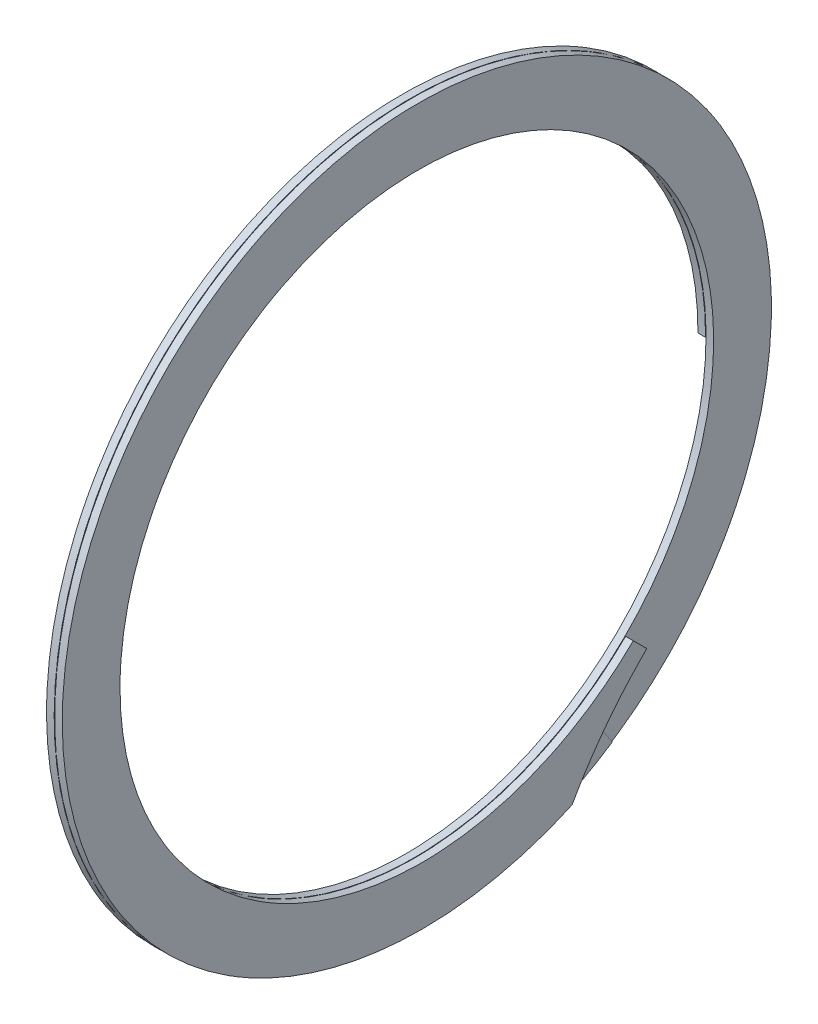
ISO-10303-21;
HEADER;
FILE_DESCRIPTION(('STEP AP214'),'2;1');
FILE_NAME('part.step','',(''),(''),'','','');
FILE_SCHEMA(('AUTOMOTIVE_DESIGN { 1 0 10303 214 1 1 1 1 }'));
ENDSEC;
DATA;
#1=APPLICATION_CONTEXT('core data for automotive mechanical design processes');
#2=APPLICATION_PROTOCOL_DEFINITION('international standard','automotive_design',2000,#1);
#3=PRODUCT_CONTEXT('',#1,'mechanical');
#4=PRODUCT('Part','Part','',(#3));
#5=PRODUCT_RELATED_PRODUCT_CATEGORY('part','',(#4));
#6=PRODUCT_DEFINITION_FORMATION('','',#4);
#7=PRODUCT_DEFINITION_CONTEXT('part definition',#1,'design');
#8=PRODUCT_DEFINITION('design','',#6,#7);
#9=PRODUCT_DEFINITION_SHAPE('','',#8);
#10=(LENGTH_UNIT() NAMED_UNIT(*) SI_UNIT(.MILLI.,.METRE.));
#11=(NAMED_UNIT(*) PLANE_ANGLE_UNIT() SI_UNIT($,.RADIAN.));
#12=(NAMED_UNIT(*) SI_UNIT($,.STERADIAN.) SOLID_ANGLE_UNIT());
#13=UNCERTAINTY_MEASURE_WITH_UNIT(LENGTH_MEASURE(1.E-05),#10,'distance_accuracy_value','');
#14=(GEOMETRIC_REPRESENTATION_CONTEXT(3) GLOBAL_UNCERTAINTY_ASSIGNED_CONTEXT((#13)) GLOBAL_UNIT_ASSIGNED_CONTEXT((#10,
#11,#12)) REPRESENTATION_CONTEXT('',''));
#15=CARTESIAN_POINT('',(0.,0.,0.));
#16=DIRECTION('',(0.,0.,1.));
#17=DIRECTION('',(1.,0.,0.));
#18=AXIS2_PLACEMENT_3D('',#15,#16,#17);
#19=CARTESIAN_POINT('',(0.9398,0.,-44.069));
#20=DIRECTION('',(0.,1.,0.));
#21=DIRECTION('',(0.,0.,1.));
#22=AXIS2_PLACEMENT_3D('',#19,#20,#21);
#23=PLANE('',#22);
#24=DIRECTION('',(-1.,0.,0.));
#25=VECTOR('',#24,1.);
#26=CARTESIAN_POINT('',(0.971127709578949,0.,-39.3107333333333));
#27=LINE('',#26,#25);
#28=CARTESIAN_POINT('',(0.9398,0.,-39.3107333333333));
#29=VERTEX_POINT('',#28);
#30=CARTESIAN_POINT('',(0.,0.,-39.3107333333333));
#31=VERTEX_POINT('',#30);
#32=EDGE_CURVE('E55',#29,#31,#27,.T.);
#33=ORIENTED_EDGE('',*,*,#32,.F.);
#34=DIRECTION('',(0.,0.,-1.));
#35=VECTOR('',#34,1.);
#36=CARTESIAN_POINT('',(0.9398,0.,-36.9316));
#37=LINE('',#36,#35);
#38=CARTESIAN_POINT('',(0.9398,0.,-36.9316));
#39=VERTEX_POINT('',#38);
#40=EDGE_CURVE('E185',#39,#29,#37,.T.);
#41=ORIENTED_EDGE('',*,*,#40,.F.);
#42=DIRECTION('',(1.,0.,0.));
#43=VECTOR('',#42,1.);
#44=CARTESIAN_POINT('',(0.9398,0.,-36.9316));
#45=LINE('',#44,#43);
#46=CARTESIAN_POINT('',(0.,0.,-36.9316));
#47=VERTEX_POINT('',#46);
#48=EDGE_CURVE('E206',#47,#39,#45,.T.);
#49=ORIENTED_EDGE('',*,*,#48,.F.);
#50=DIRECTION('',(0.,0.,1.));
#51=VECTOR('',#50,1.);
#52=CARTESIAN_POINT('',(0.,0.,-36.9316));
#53=LINE('',#52,#51);
#54=EDGE_CURVE('E187',#31,#47,#53,.T.);
#55=ORIENTED_EDGE('',*,*,#54,.F.);
#56=EDGE_LOOP('',(#33,#41,#49,#55));
#57=FACE_BOUND('',#56,.T.);
#58=ADVANCED_FACE('F30',(#57),#23,.F.);
#59=CARTESIAN_POINT('',(0.9398,0.,-36.9316));
#60=CARTESIAN_POINT('',(1.02333777777778,21.3224692016036,-36.9316));
#61=CARTESIAN_POINT('',(1.10687555555555,31.9837038024054,-18.4658));
#62=CARTESIAN_POINT('',(1.19041333333333,42.6449384032072,0.));
#63=CARTESIAN_POINT('',(1.27395111111111,31.9837038024054,18.4658));
#64=CARTESIAN_POINT('',(1.35748888888889,21.3224692016036,36.9316));
#65=CARTESIAN_POINT('',(1.44102666666667,0.,36.9316));
#66=CARTESIAN_POINT('',(1.52456444444444,-21.3224692016036,36.9316));
#67=CARTESIAN_POINT('',(1.60810222222222,-31.9837038024054,18.4658));
#68=CARTESIAN_POINT('',(1.69164,-42.6449384032072,0.));
#69=CARTESIAN_POINT('',(1.77517777777778,-31.9837038024054,-18.4658));
#70=CARTESIAN_POINT('',(1.85871555555555,-21.3224692016036,-36.9316));
#71=CARTESIAN_POINT('',(1.94225333333333,0.,-36.9316));
#72=CARTESIAN_POINT('',(2.02579111111111,21.3224692016036,-36.9316));
#73=CARTESIAN_POINT('',(2.10932888888889,31.9837038024054,-18.4658));
#74=CARTESIAN_POINT('',(2.19286666666666,42.6449384032072,0.));
#75=CARTESIAN_POINT('',(2.27640444444444,31.9837038024054,18.4658));
#76=CARTESIAN_POINT('',(2.35994222222222,21.3224692016036,36.9316));
#77=CARTESIAN_POINT('',(2.44348,0.,36.9316));
#78=CARTESIAN_POINT('',(2.52701777777777,-21.3224692016036,36.9316));
#79=CARTESIAN_POINT('',(2.61055555555555,-31.9837038024054,18.4658));
#80=CARTESIAN_POINT('',(2.69409333333333,-42.6449384032072,0.));
#81=CARTESIAN_POINT('',(2.77763111111111,-31.9837038024054,-18.4658));
#82=CARTESIAN_POINT('',(2.86116888888888,-21.3224692016036,-36.9316));
#83=CARTESIAN_POINT('',(2.94470666666666,0.,-36.9316));
#84=CARTESIAN_POINT('',(0.9398,0.,-44.069));
#85=CARTESIAN_POINT('',(1.02333777777778,25.4432490129176,-44.069));
#86=CARTESIAN_POINT('',(1.10687555555555,38.1648735193764,-22.0345));
#87=CARTESIAN_POINT('',(1.19041333333333,50.8864980258352,0.));
#88=CARTESIAN_POINT('',(1.27395111111111,38.1648735193764,22.0345));
#89=CARTESIAN_POINT('',(1.35748888888889,25.4432490129176,44.069));
#90=CARTESIAN_POINT('',(1.44102666666667,0.,44.069));
#91=CARTESIAN_POINT('',(1.52456444444444,-25.4432490129176,44.069));
#92=CARTESIAN_POINT('',(1.60810222222222,-38.1648735193764,22.0345));
#93=CARTESIAN_POINT('',(1.69164,-50.8864980258352,0.));
#94=CARTESIAN_POINT('',(1.77517777777778,-38.1648735193764,-22.0345));
#95=CARTESIAN_POINT('',(1.85871555555555,-25.4432490129176,-44.069));
#96=CARTESIAN_POINT('',(1.94225333333333,0.,-44.069));
#97=CARTESIAN_POINT('',(2.02579111111111,25.4432490129176,-44.069));
#98=CARTESIAN_POINT('',(2.10932888888889,38.1648735193764,-22.0345));
#99=CARTESIAN_POINT('',(2.19286666666666,50.8864980258352,0.));
#100=CARTESIAN_POINT('',(2.27640444444444,38.1648735193764,22.0345));
#101=CARTESIAN_POINT('',(2.35994222222222,25.4432490129176,44.069));
#102=CARTESIAN_POINT('',(2.44348,0.,44.069));
#103=CARTESIAN_POINT('',(2.52701777777777,-25.4432490129176,44.069));
#104=CARTESIAN_POINT('',(2.61055555555555,-38.1648735193764,22.0345));
#105=CARTESIAN_POINT('',(2.69409333333333,-50.8864980258352,0.));
#106=CARTESIAN_POINT('',(2.77763111111111,-38.1648735193764,-22.0345));
#107=CARTESIAN_POINT('',(2.86116888888888,-25.4432490129176,-44.069));
#108=CARTESIAN_POINT('',(2.94470666666666,0.,-44.069));
#109=(BOUNDED_SURFACE() B_SPLINE_SURFACE(1,2,((#59,#60,#61,#62,#63,#64,#65,#66,#67,#68,#69,#70,
#71,#72,#73,#74,#75,#76,#77,#78,#79,#80,#81,#82,#83),(#84,#85,#86,#87,#88,#89,#90,#91,#92,#93,
#94,#95,#96,#97,#98,#99,#100,#101,#102,#103,#104,#105,#106,#107,#108)),.UNSPECIFIED.,.F.,.F.,
.F.) B_SPLINE_SURFACE_WITH_KNOTS((2,2),(3,2,2,2,2,2,2,2,2,2,2,2,3),(0.,1.),(0.,
0.0833333333333333,0.166666666666667,0.25,0.333333333333333,0.416666666666667,0.5,
0.583333333333333,0.666666666666667,0.75,0.833333333333333,0.916666666666667,1.),
.UNSPECIFIED.) GEOMETRIC_REPRESENTATION_ITEM() RATIONAL_B_SPLINE_SURFACE(((1.,0.866025403784439,
1.,0.866025403784439,1.,0.866025403784439,1.,0.866025403784439,1.,0.866025403784439,1.,
0.866025403784439,1.,0.866025403784439,1.,0.866025403784439,1.,0.866025403784439,1.,
0.866025403784439,1.,0.866025403784439,1.,0.866025403784439,1.),(1.,0.866025403784439,1.,
0.866025403784439,1.,0.866025403784439,1.,0.866025403784439,1.,0.866025403784439,1.,
0.866025403784439,1.,0.866025403784439,1.,0.866025403784439,1.,0.866025403784439,1.,
0.866025403784439,1.,0.866025403784439,1.,0.866025403784439,1.))) REPRESENTATION_ITEM('') SURFACE());
#110=CARTESIAN_POINT('',(2.81792656044412,-27.7968848553425,-27.7968873714894));
#111=CARTESIAN_POINT('',(2.81533401196487,-28.2434468041826,-27.3503288294392));
#112=CARTESIAN_POINT('',(2.81275858806625,-28.6976311774025,-26.9114911753032));
#113=CARTESIAN_POINT('',(2.80767385636024,-29.620805512426,-26.0496797980909));
#114=CARTESIAN_POINT('',(2.80516454823388,-30.0897954027738,-25.6267059984728));
#115=CARTESIAN_POINT('',(2.79780751315575,-31.5136851073116,-24.3862459736756));
#116=CARTESIAN_POINT('',(2.79310481954177,-32.4898617536762,-23.592866141355));
#117=CARTESIAN_POINT('',(2.78641888899766,-34.0025363791832,-22.4470613475543));
#118=CARTESIAN_POINT('',(2.78423265889086,-34.5199809184539,-22.0691345056973));
#119=CARTESIAN_POINT('',(2.7800330184999,-35.5677626271187,-21.3315211657516));
#120=CARTESIAN_POINT('',(2.77801960892293,-36.0980998492578,-20.9718347423045));
#121=CARTESIAN_POINT('',(2.77406685459246,-37.1735796810763,-20.269480596558));
#122=CARTESIAN_POINT('',(2.77212791526093,-37.7187815029161,-19.9269036230695));
#123=CARTESIAN_POINT('',(2.76834317871875,-38.8208482971374,-19.2610539872907));
#124=CARTESIAN_POINT('',(2.76649738145153,-39.3777132624363,-18.937781313278));
#125=CARTESIAN_POINT('',(2.76470251825378,-39.9400773685116,-18.6243652454871));
#126=B_SPLINE_CURVE_WITH_KNOTS('',3,(#110,#111,#112,#113,#114,#115,#116,#117,#118,#119,#120,
#121,#122,#123,#124,#125),.UNSPECIFIED.,.F.,.F.,(4,2,2,2,2,2,2,4),(0.,1.89437810631307,
3.78874707121644,7.55904184406643,9.48104673764613,11.4030594956239,13.3343703349922,
15.2656800015798),.UNSPECIFIED.);
#127=CARTESIAN_POINT('',(2.81866328644976,-27.7968831536339,-27.7968865570519));
#128=VERTEX_POINT('',#127);
#129=CARTESIAN_POINT('',(2.76470251825378,-39.9400773685116,-18.624365245487));
#130=VERTEX_POINT('',#129);
#131=EDGE_CURVE('E106',#128,#130,#126,.T.);
#132=DIRECTION('',(0.,-0.707106781186528,-0.707106781186567));
#133=VECTOR('',#132,1.);
#134=CARTESIAN_POINT('',(2.8194,-26.1145848000684,-26.1145848000698));
#135=LINE('',#134,#133);
#136=CARTESIAN_POINT('',(2.8186599112469,-26.114583754539,-26.114585845599));
#137=VERTEX_POINT('',#136);
#138=EDGE_CURVE('E33',#137,#128,#135,.T.);
#139=CARTESIAN_POINT('',(0.9398,0.,-36.9316));
#140=CARTESIAN_POINT('',(1.02333777777778,21.3224692016036,-36.9316));
#141=CARTESIAN_POINT('',(1.10687555555555,31.9837038024054,-18.4658));
#142=CARTESIAN_POINT('',(1.19041333333333,42.6449384032072,0.));
#143=CARTESIAN_POINT('',(1.27395111111111,31.9837038024054,18.4658));
#144=CARTESIAN_POINT('',(1.35748888888889,21.3224692016036,36.9316));
#145=CARTESIAN_POINT('',(1.44102666666667,0.,36.9316));
#146=CARTESIAN_POINT('',(1.52456444444444,-21.3224692016036,36.9316));
#147=CARTESIAN_POINT('',(1.60810222222222,-31.9837038024054,18.4658));
#148=CARTESIAN_POINT('',(1.69164,-42.6449384032072,0.));
#149=CARTESIAN_POINT('',(1.77517777777778,-31.9837038024054,-18.4658));
#150=CARTESIAN_POINT('',(1.85871555555555,-21.3224692016036,-36.9316));
#151=CARTESIAN_POINT('',(1.94225333333333,0.,-36.9316));
#152=CARTESIAN_POINT('',(2.02579111111111,21.3224692016036,-36.9316));
#153=CARTESIAN_POINT('',(2.10932888888889,31.9837038024054,-18.4658));
#154=CARTESIAN_POINT('',(2.19286666666666,42.6449384032072,0.));
#155=CARTESIAN_POINT('',(2.27640444444444,31.9837038024054,18.4658));
#156=CARTESIAN_POINT('',(2.35994222222222,21.3224692016036,36.9316));
#157=CARTESIAN_POINT('',(2.44348,0.,36.9316));
#158=CARTESIAN_POINT('',(2.52701777777777,-21.3224692016035,36.9316));
#159=CARTESIAN_POINT('',(2.61055555555555,-31.9837038024054,18.4658000000001));
#160=CARTESIAN_POINT('',(2.69409333333333,-42.6449384032072,0.));
#161=CARTESIAN_POINT('',(2.77763111111111,-31.9837038024054,-18.4658));
#162=CARTESIAN_POINT('',(2.86116888888888,-21.3224692016036,-36.9316));
#163=CARTESIAN_POINT('',(2.94470666666666,0.,-36.9316));
#164=(BOUNDED_CURVE() B_SPLINE_CURVE(2,(#139,#140,#141,#142,#143,#144,#145,#146,#147,#148,#149,
#150,#151,#152,#153,#154,#155,#156,#157,#158,#159,#160,#161,#162,#163),.UNSPECIFIED.,.F.,
.F.) B_SPLINE_CURVE_WITH_KNOTS((3,2,2,2,2,2,2,2,2,2,2,2,3),(0.,0.0833333333333333,
0.166666666666667,0.25,0.333333333333333,0.416666666666667,0.5,0.583333333333333,
0.666666666666667,0.75,0.833333333333333,0.916666666666667,1.),
.UNSPECIFIED.) CURVE() GEOMETRIC_REPRESENTATION_ITEM() RATIONAL_B_SPLINE_CURVE((1.,
0.866025403784439,1.,0.866025403784439,1.,0.866025403784439,1.,0.866025403784439,1.,
0.866025403784439,1.,0.866025403784439,1.,0.866025403784439,1.,0.866025403784439,1.,
0.866025403784439,1.,0.866025403784439,1.,0.866025403784439,1.,0.866025403784439,1.)) REPRESENTATION_ITEM(''));
#165=EDGE_CURVE('E192',#39,#137,#164,.T.);
#166=CARTESIAN_POINT('',(0.9398,0.,-39.3107333333333));
#167=CARTESIAN_POINT('',(0.940828336504758,0.279388839419639,-39.3107331572965));
#168=CARTESIAN_POINT('',(0.94186303223891,0.558777647561294,-39.3128573279635));
#169=CARTESIAN_POINT('',(0.943941426715278,1.11723332702022,-39.321349183513));
#170=CARTESIAN_POINT('',(0.944985116287194,1.3963002578371,-39.3277129579827));
#171=CARTESIAN_POINT('',(0.947078964285285,1.95411255380565,-39.3446729918282));
#172=CARTESIAN_POINT('',(0.948129117746551,2.23285800793763,-39.3552663253464));
#173=CARTESIAN_POINT('',(0.950233308891387,2.79002764385665,-39.3806771333487));
#174=CARTESIAN_POINT('',(0.951287344563262,3.06845191448296,-39.3954926600948));
#175=CARTESIAN_POINT('',(0.953396720188811,3.62497939389588,-39.4293425105249));
#176=CARTESIAN_POINT('',(0.954452059785403,3.90308266194214,-39.4483758599439));
#177=CARTESIAN_POINT('',(0.956561488901052,4.45896848772747,-39.4906589289226));
#178=CARTESIAN_POINT('',(0.957615578420107,4.7367510454663,-39.5139086484855));
#179=CARTESIAN_POINT('',(0.959720004078089,5.29199560781322,-39.5646249661306));
#180=CARTESIAN_POINT('',(0.960770339294585,5.56945752364048,-39.5920925362305));
#181=CARTESIAN_POINT('',(0.962864829891317,6.12406043728941,-39.6512479361771));
#182=CARTESIAN_POINT('',(0.963908982201025,6.40120122833008,-39.6829377047898));
#183=CARTESIAN_POINT('',(0.965988766032476,6.95516121492964,-39.7505438605575));
#184=CARTESIAN_POINT('',(0.967024391167329,7.23198005590388,-39.7864631533688));
#185=CARTESIAN_POINT('',(0.969084935658874,7.78529519580233,-39.8625373786737));
#186=CARTESIAN_POINT('',(0.970109844265371,8.06179096208288,-39.9026961855955));
#187=CARTESIAN_POINT('',(0.971127709580641,8.33796544655358,-39.9449549043137));
#188=B_SPLINE_CURVE_WITH_KNOTS('',3,(#166,#167,#168,#169,#170,#171,#172,#173,#174,#175,#176,
#177,#178,#179,#180,#181,#182,#183,#184,#185,#186,#187),.UNSPECIFIED.,.F.,.F.,(4,2,2,2,2,2,2,2,
2,2,4),(0.,0.838164105377737,1.67555619563044,2.51237000887464,3.34879841506194,
4.18503381761285,5.02126922078727,5.8576976271907,6.69451144042866,7.53190353084172,
8.37006763705949),.UNSPECIFIED.);
#189=CARTESIAN_POINT('',(0.971127709578949,8.33796544609468,-39.9449549042435));
#190=VERTEX_POINT('',#189);
#191=EDGE_CURVE('E173',#29,#190,#188,.T.);
#192=CARTESIAN_POINT('',(0.971127709578949,8.19962098845372,-39.2821837333333));
#193=CARTESIAN_POINT('',(0.971127709578949,8.33380472005686,-39.9250219823547));
#194=CARTESIAN_POINT('',(0.971127709578949,8.46798845165997,-40.5678602313761));
#195=CARTESIAN_POINT('',(0.971127709578949,8.73635591486614,-41.8535367294188));
#196=CARTESIAN_POINT('',(0.971127709578949,8.87053964646921,-42.4963749784402));
#197=CARTESIAN_POINT('',(0.971127709578949,9.00472337807225,-43.1392132274616));
#198=B_SPLINE_CURVE_WITH_KNOTS('',3,(#192,#193,#194,#195,#196,#197),.UNSPECIFIED.,.F.,.F.,(4,2,
4),(0.,1.9700803521903,3.9401607043806),.UNSPECIFIED.);
#199=CARTESIAN_POINT('',(0.971127709578949,9.0047233780723,-43.1392132274616));
#200=VERTEX_POINT('',#199);
#201=EDGE_CURVE('E179',#190,#200,#198,.T.);
#202=CARTESIAN_POINT('',(0.9398,0.,-44.069));
#203=CARTESIAN_POINT('',(1.02333777777778,25.4432490129176,-44.069));
#204=CARTESIAN_POINT('',(1.10687555555555,38.1648735193764,-22.0345));
#205=CARTESIAN_POINT('',(1.19041333333333,50.8864980258352,0.));
#206=CARTESIAN_POINT('',(1.27395111111111,38.1648735193764,22.0345));
#207=CARTESIAN_POINT('',(1.35748888888889,25.4432490129176,44.069));
#208=CARTESIAN_POINT('',(1.44102666666667,0.,44.069));
#209=CARTESIAN_POINT('',(1.52456444444444,-25.4432490129176,44.069));
#210=CARTESIAN_POINT('',(1.60810222222222,-38.1648735193764,22.0345));
#211=CARTESIAN_POINT('',(1.69164,-50.8864980258352,0.));
#212=CARTESIAN_POINT('',(1.77517777777778,-38.1648735193764,-22.0345));
#213=CARTESIAN_POINT('',(1.85871555555555,-25.4432490129176,-44.069));
#214=CARTESIAN_POINT('',(1.94225333333333,0.,-44.069));
#215=CARTESIAN_POINT('',(2.02579111111111,25.4432490129176,-44.069));
#216=CARTESIAN_POINT('',(2.10932888888889,38.1648735193764,-22.0345));
#217=CARTESIAN_POINT('',(2.19286666666666,50.8864980258352,0.));
#218=CARTESIAN_POINT('',(2.27640444444444,38.1648735193765,22.0345));
#219=CARTESIAN_POINT('',(2.35994222222222,25.4432490129177,44.069));
#220=CARTESIAN_POINT('',(2.44348,0.,44.069));
#221=CARTESIAN_POINT('',(2.52701777777777,-25.4432490129176,44.069));
#222=CARTESIAN_POINT('',(2.61055555555555,-38.1648735193764,22.0345000000001));
#223=CARTESIAN_POINT('',(2.69409333333333,-50.8864980258352,0.));
#224=CARTESIAN_POINT('',(2.77763111111111,-38.1648735193765,-22.0345));
#225=CARTESIAN_POINT('',(2.86116888888888,-25.4432490129177,-44.069));
#226=CARTESIAN_POINT('',(2.94470666666666,0.,-44.069));
#227=(BOUNDED_CURVE() B_SPLINE_CURVE(2,(#202,#203,#204,#205,#206,#207,#208,#209,#210,#211,#212,
#213,#214,#215,#216,#217,#218,#219,#220,#221,#222,#223,#224,#225,#226),.UNSPECIFIED.,.F.,
.F.) B_SPLINE_CURVE_WITH_KNOTS((3,2,2,2,2,2,2,2,2,2,2,2,3),(0.,0.0833333333333333,
0.166666666666667,0.25,0.333333333333333,0.416666666666667,0.5,0.583333333333333,
0.666666666666667,0.75,0.833333333333333,0.916666666666667,1.),
.UNSPECIFIED.) CURVE() GEOMETRIC_REPRESENTATION_ITEM() RATIONAL_B_SPLINE_CURVE((1.,
0.866025403784439,1.,0.866025403784439,1.,0.866025403784439,1.,0.866025403784439,1.,
0.866025403784439,1.,0.866025403784439,1.,0.866025403784439,1.,0.866025403784439,1.,
0.866025403784439,1.,0.866025403784439,1.,0.866025403784439,1.,0.866025403784439,1.)) REPRESENTATION_ITEM(''));
#228=EDGE_CURVE('E207',#200,#130,#227,.T.);
#229=ORIENTED_EDGE('',*,*,#131,.F.);
#230=ORIENTED_EDGE('',*,*,#138,.F.);
#231=ORIENTED_EDGE('',*,*,#165,.F.);
#232=ORIENTED_EDGE('',*,*,#40,.T.);
#233=ORIENTED_EDGE('',*,*,#191,.T.);
#234=ORIENTED_EDGE('',*,*,#201,.T.);
#235=ORIENTED_EDGE('',*,*,#228,.T.);
#236=EDGE_LOOP('',(#229,#230,#231,#232,#233,#234,#235));
#237=FACE_BOUND('',#236,.T.);
#238=ADVANCED_FACE('F150',(#237),#109,.T.);
#239=CARTESIAN_POINT('',(0.,0.,0.));
#240=DIRECTION('',(1.,0.,0.));
#241=DIRECTION('',(0.,0.,-1.));
#242=AXIS2_PLACEMENT_3D('',#239,#240,#241);
#243=CYLINDRICAL_SURFACE('',#242,44.069);
#244=DIRECTION('',(1.,0.,0.));
#245=VECTOR('',#244,1.);
#246=CARTESIAN_POINT('',(1.84755537527299,-39.9400773685116,-18.624365245487));
#247=LINE('',#246,#245);
#248=CARTESIAN_POINT('',(1.84755537527299,-39.9400773685116,-18.624365245487));
#249=VERTEX_POINT('',#248);
#250=EDGE_CURVE('E103',#249,#130,#247,.T.);
#251=ORIENTED_EDGE('',*,*,#250,.T.);
#252=ORIENTED_EDGE('',*,*,#228,.F.);
#253=CARTESIAN_POINT('',(0.971127709578949,0.,0.));
#254=DIRECTION('',(1.,0.,0.));
#255=DIRECTION('',(0.,0.,1.));
#256=AXIS2_PLACEMENT_3D('',#253,#254,#255);
#257=CIRCLE('',#256,44.069);
#258=CARTESIAN_POINT('',(0.971127709578949,15.0724856962186,-41.4113141054143));
#259=VERTEX_POINT('',#258);
#260=EDGE_CURVE('E307',#200,#259,#257,.T.);
#261=ORIENTED_EDGE('',*,*,#260,.T.);
#262=DIRECTION('',(-1.,0.,0.));
#263=VECTOR('',#262,1.);
#264=CARTESIAN_POINT('',(0.971127709578949,15.0724856962186,-41.4113141054143));
#265=LINE('',#264,#263);
#266=CARTESIAN_POINT('',(0.0545254120228644,15.0724856962186,-41.4113141054143));
#267=VERTEX_POINT('',#266);
#268=EDGE_CURVE('E306',#259,#267,#265,.T.);
#269=ORIENTED_EDGE('',*,*,#268,.T.);
#270=CARTESIAN_POINT('',(0.,0.,-44.069));
#271=CARTESIAN_POINT('',(0.0835377777777776,25.4432490129176,-44.069));
#272=CARTESIAN_POINT('',(0.167075555555555,38.1648735193764,-22.0345));
#273=CARTESIAN_POINT('',(0.250613333333333,50.8864980258352,0.));
#274=CARTESIAN_POINT('',(0.33415111111111,38.1648735193764,22.0345));
#275=CARTESIAN_POINT('',(0.417688888888888,25.4432490129176,44.069));
#276=CARTESIAN_POINT('',(0.501226666666666,0.,44.069));
#277=CARTESIAN_POINT('',(0.584764444444443,-25.4432490129176,44.069));
#278=CARTESIAN_POINT('',(0.668302222222221,-38.1648735193764,22.0345));
#279=CARTESIAN_POINT('',(0.751839999999998,-50.8864980258352,0.));
#280=CARTESIAN_POINT('',(0.835377777777776,-38.1648735193764,-22.0345));
#281=CARTESIAN_POINT('',(0.918915555555553,-25.4432490129176,-44.069));
#282=CARTESIAN_POINT('',(1.00245333333333,0.,-44.069));
#283=CARTESIAN_POINT('',(1.08599111111111,25.4432490129176,-44.069));
#284=CARTESIAN_POINT('',(1.16952888888889,38.1648735193764,-22.0345));
#285=CARTESIAN_POINT('',(1.25306666666666,50.8864980258352,0.));
#286=CARTESIAN_POINT('',(1.33660444444444,38.1648735193765,22.0345));
#287=CARTESIAN_POINT('',(1.42014222222222,25.4432490129177,44.069));
#288=CARTESIAN_POINT('',(1.50368,0.,44.069));
#289=CARTESIAN_POINT('',(1.58721777777777,-25.4432490129176,44.069));
#290=CARTESIAN_POINT('',(1.67075555555555,-38.1648735193764,22.0345000000001));
#291=CARTESIAN_POINT('',(1.75429333333333,-50.8864980258352,0.));
#292=CARTESIAN_POINT('',(1.83783111111111,-38.1648735193765,-22.0345));
#293=CARTESIAN_POINT('',(1.92136888888888,-25.4432490129177,-44.069));
#294=CARTESIAN_POINT('',(2.00490666666666,0.,-44.069));
#295=(BOUNDED_CURVE() B_SPLINE_CURVE(2,(#270,#271,#272,#273,#274,#275,#276,#277,#278,#279,#280,
#281,#282,#283,#284,#285,#286,#287,#288,#289,#290,#291,#292,#293,#294),.UNSPECIFIED.,.F.,
.F.) B_SPLINE_CURVE_WITH_KNOTS((3,2,2,2,2,2,2,2,2,2,2,2,3),(0.,0.0833333333333333,
0.166666666666667,0.25,0.333333333333333,0.416666666666667,0.5,0.583333333333333,
0.666666666666667,0.75,0.833333333333333,0.916666666666667,1.),
.UNSPECIFIED.) CURVE() GEOMETRIC_REPRESENTATION_ITEM() RATIONAL_B_SPLINE_CURVE((1.,
0.866025403784439,1.,0.866025403784439,1.,0.866025403784439,1.,0.866025403784439,1.,
0.866025403784439,1.,0.866025403784439,1.,0.866025403784439,1.,0.866025403784439,1.,
0.866025403784439,1.,0.866025403784439,1.,0.866025403784439,1.,0.866025403784439,1.)) REPRESENTATION_ITEM(''));
#296=CARTESIAN_POINT('',(1.84755537527299,-36.6286137925527,-24.5034979673518));
#297=VERTEX_POINT('',#296);
#298=EDGE_CURVE('E115',#267,#297,#295,.T.);
#299=ORIENTED_EDGE('',*,*,#298,.T.);
#300=CARTESIAN_POINT('',(1.84755537527299,0.,0.));
#301=DIRECTION('',(1.,0.,0.));
#302=DIRECTION('',(0.,0.,-1.));
#303=AXIS2_PLACEMENT_3D('',#300,#301,#302);
#304=CIRCLE('',#303,44.069);
#305=EDGE_CURVE('E100',#249,#297,#304,.T.);
#306=ORIENTED_EDGE('',*,*,#305,.F.);
#307=EDGE_LOOP('',(#251,#252,#261,#269,#299,#306));
#308=FACE_BOUND('',#307,.T.);
#309=ADVANCED_FACE('F112',(#308),#243,.T.);
#310=CARTESIAN_POINT('',(0.,0.,-44.069));
#311=CARTESIAN_POINT('',(0.0835377777777776,25.4432490129176,-44.069));
#312=CARTESIAN_POINT('',(0.167075555555555,38.1648735193764,-22.0345));
#313=CARTESIAN_POINT('',(0.250613333333333,50.8864980258352,0.));
#314=CARTESIAN_POINT('',(0.33415111111111,38.1648735193764,22.0345));
#315=CARTESIAN_POINT('',(0.417688888888888,25.4432490129176,44.069));
#316=CARTESIAN_POINT('',(0.501226666666666,0.,44.069));
#317=CARTESIAN_POINT('',(0.584764444444443,-25.4432490129176,44.069));
#318=CARTESIAN_POINT('',(0.668302222222221,-38.1648735193764,22.0345));
#319=CARTESIAN_POINT('',(0.751839999999998,-50.8864980258352,0.));
#320=CARTESIAN_POINT('',(0.835377777777776,-38.1648735193764,-22.0345));
#321=CARTESIAN_POINT('',(0.918915555555553,-25.4432490129176,-44.069));
#322=CARTESIAN_POINT('',(1.00245333333333,0.,-44.069));
#323=CARTESIAN_POINT('',(1.08599111111111,25.4432490129176,-44.069));
#324=CARTESIAN_POINT('',(1.16952888888889,38.1648735193764,-22.0345));
#325=CARTESIAN_POINT('',(1.25306666666666,50.8864980258352,0.));
#326=CARTESIAN_POINT('',(1.33660444444444,38.1648735193764,22.0345));
#327=CARTESIAN_POINT('',(1.42014222222222,25.4432490129176,44.069));
#328=CARTESIAN_POINT('',(1.50368,0.,44.069));
#329=CARTESIAN_POINT('',(1.58721777777777,-25.4432490129176,44.069));
#330=CARTESIAN_POINT('',(1.67075555555555,-38.1648735193764,22.0345));
#331=CARTESIAN_POINT('',(1.75429333333333,-50.8864980258352,0.));
#332=CARTESIAN_POINT('',(1.83783111111111,-38.1648735193764,-22.0345));
#333=CARTESIAN_POINT('',(1.92136888888888,-25.4432490129176,-44.069));
#334=CARTESIAN_POINT('',(2.00490666666666,0.,-44.069));
#335=CARTESIAN_POINT('',(0.,0.,-36.9316));
#336=CARTESIAN_POINT('',(0.0835377777777776,21.3224692016036,-36.9316));
#337=CARTESIAN_POINT('',(0.167075555555555,31.9837038024054,-18.4658));
#338=CARTESIAN_POINT('',(0.250613333333333,42.6449384032072,0.));
#339=CARTESIAN_POINT('',(0.33415111111111,31.9837038024054,18.4658));
#340=CARTESIAN_POINT('',(0.417688888888888,21.3224692016036,36.9316));
#341=CARTESIAN_POINT('',(0.501226666666666,0.,36.9316));
#342=CARTESIAN_POINT('',(0.584764444444443,-21.3224692016036,36.9316));
#343=CARTESIAN_POINT('',(0.668302222222221,-31.9837038024054,18.4658));
#344=CARTESIAN_POINT('',(0.751839999999998,-42.6449384032072,0.));
#345=CARTESIAN_POINT('',(0.835377777777776,-31.9837038024054,-18.4658));
#346=CARTESIAN_POINT('',(0.918915555555553,-21.3224692016036,-36.9316));
#347=CARTESIAN_POINT('',(1.00245333333333,0.,-36.9316));
#348=CARTESIAN_POINT('',(1.08599111111111,21.3224692016036,-36.9316));
#349=CARTESIAN_POINT('',(1.16952888888889,31.9837038024054,-18.4658));
#350=CARTESIAN_POINT('',(1.25306666666666,42.6449384032072,0.));
#351=CARTESIAN_POINT('',(1.33660444444444,31.9837038024054,18.4658));
#352=CARTESIAN_POINT('',(1.42014222222222,21.3224692016036,36.9316));
#353=CARTESIAN_POINT('',(1.50368,0.,36.9316));
#354=CARTESIAN_POINT('',(1.58721777777777,-21.3224692016036,36.9316));
#355=CARTESIAN_POINT('',(1.67075555555555,-31.9837038024054,18.4658));
#356=CARTESIAN_POINT('',(1.75429333333333,-42.6449384032072,0.));
#357=CARTESIAN_POINT('',(1.83783111111111,-31.9837038024054,-18.4658));
#358=CARTESIAN_POINT('',(1.92136888888888,-21.3224692016036,-36.9316));
#359=CARTESIAN_POINT('',(2.00490666666666,0.,-36.9316));
#360=(BOUNDED_SURFACE() B_SPLINE_SURFACE(1,2,((#310,#311,#312,#313,#314,#315,#316,#317,#318,
#319,#320,#321,#322,#323,#324,#325,#326,#327,#328,#329,#330,#331,#332,#333,#334),(#335,#336,
#337,#338,#339,#340,#341,#342,#343,#344,#345,#346,#347,#348,#349,#350,#351,#352,#353,#354,#355,
#356,#357,#358,#359)),.UNSPECIFIED.,.F.,.F.,.F.) B_SPLINE_SURFACE_WITH_KNOTS((2,2),(3,2,2,2,2,2,
2,2,2,2,2,2,3),(0.,1.),(0.,0.0833333333333333,0.166666666666667,0.25,0.333333333333333,
0.416666666666667,0.5,0.583333333333333,0.666666666666667,0.75,0.833333333333333,
0.916666666666667,1.),
.UNSPECIFIED.) GEOMETRIC_REPRESENTATION_ITEM() RATIONAL_B_SPLINE_SURFACE(((1.,0.866025403784439,
1.,0.866025403784439,1.,0.866025403784439,1.,0.866025403784439,1.,0.866025403784439,1.,
0.866025403784439,1.,0.866025403784439,1.,0.866025403784439,1.,0.866025403784439,1.,
0.866025403784439,1.,0.866025403784439,1.,0.866025403784439,1.),(1.,0.866025403784439,1.,
0.866025403784439,1.,0.866025403784439,1.,0.866025403784439,1.,0.866025403784439,1.,
0.866025403784439,1.,0.866025403784439,1.,0.866025403784439,1.,0.866025403784439,1.,
0.866025403784439,1.,0.866025403784439,1.,0.866025403784439,1.))) REPRESENTATION_ITEM('') SURFACE());
#361=CARTESIAN_POINT('',(1.84755537527243,-33.7935965346824,-22.6069522770763));
#362=CARTESIAN_POINT('',(1.84847610965874,-33.5813326294615,-22.7654569948752));
#363=CARTESIAN_POINT('',(1.84940943389388,-33.3702115069606,-22.9254920017737));
#364=CARTESIAN_POINT('',(1.85129915215834,-32.9504722615879,-23.2484549983224));
#365=CARTESIAN_POINT('',(1.85225552643465,-32.7418522099816,-23.4113804814104));
#366=CARTESIAN_POINT('',(1.85419016383734,-32.3271095420107,-23.7401174496233));
#367=CARTESIAN_POINT('',(1.8551684129985,-32.1209854548583,-23.9059270792507));
#368=CARTESIAN_POINT('',(1.85714540722293,-31.7112304971723,-24.2404270634708));
#369=CARTESIAN_POINT('',(1.85814414362798,-31.5075986292026,-24.4091161962791));
#370=CARTESIAN_POINT('',(1.86016057632617,-31.1028253933874,-24.7493718161342));
#371=CARTESIAN_POINT('',(1.86117826864219,-30.9016835175374,-24.920937698875));
#372=CARTESIAN_POINT('',(1.86323092480202,-30.5018888760259,-25.2669454007759));
#373=CARTESIAN_POINT('',(1.86426588864569,-30.3032361103416,-25.4413872199096));
#374=CARTESIAN_POINT('',(1.86635126138685,-29.9084198331228,-25.7931471951293));
#375=CARTESIAN_POINT('',(1.86740167344532,-29.7122568467804,-25.9704659406738));
#376=CARTESIAN_POINT('',(1.86951598660944,-29.3224219870823,-26.3279817922037));
#377=CARTESIAN_POINT('',(1.87057989312485,-29.1287511797885,-26.5081800605913));
#378=CARTESIAN_POINT('',(1.87271913235662,-28.7439041707585,-26.8714587693045));
#379=CARTESIAN_POINT('',(1.87379447176375,-28.5527295943163,-27.0545409313826));
#380=CARTESIAN_POINT('',(1.87595439953713,-28.1728799928797,-27.423592842008));
#381=CARTESIAN_POINT('',(1.87703899483278,-27.9842071717809,-27.6095648588955));
#382=CARTESIAN_POINT('',(1.87812656044412,-27.7968848553425,-27.7968873714894));
#383=B_SPLINE_CURVE_WITH_KNOTS('',3,(#361,#362,#363,#364,#365,#366,#367,#368,#369,#370,#371,
#372,#373,#374,#375,#376,#377,#378,#379,#380,#381,#382),.UNSPECIFIED.,.F.,.F.,(4,2,2,2,2,2,2,2,
2,2,4),(0.,0.794741510251348,1.58882460840856,2.38241446282857,3.1756755751528,3.9687720879909,
4.76186859354126,5.55512970317553,6.34871955760848,7.14280265393098,7.93754415350978),.UNSPECIFIED.);
#384=CARTESIAN_POINT('',(1.84755537527299,-33.7935965344239,-22.6069522772693));
#385=VERTEX_POINT('',#384);
#386=CARTESIAN_POINT('',(1.87886328644976,-27.7968844117065,-27.7968878151247));
#387=VERTEX_POINT('',#386);
#388=EDGE_CURVE('E47',#385,#387,#383,.T.);
#389=CARTESIAN_POINT('',(1.84755537527299,-30.6962561696667,-20.5349199103916));
#390=CARTESIAN_POINT('',(1.84755537527299,-31.2670975480838,-20.9167965119726));
#391=CARTESIAN_POINT('',(1.84755537527299,-31.8379389265009,-21.2986731135536));
#392=CARTESIAN_POINT('',(1.84755537527299,-32.979621683335,-22.0624263167156));
#393=CARTESIAN_POINT('',(1.84755537527299,-33.5504630617521,-22.4443029182966));
#394=CARTESIAN_POINT('',(1.84755537527299,-34.957074224297,-23.3852856690357));
#395=CARTESIAN_POINT('',(1.84755537527299,-35.7928440084249,-23.9443918181937));
#396=CARTESIAN_POINT('',(1.84755537527299,-36.6286137925528,-24.5034979673518));
#397=B_SPLINE_CURVE_WITH_KNOTS('',3,(#389,#390,#391,#392,#393,#394,#395,#396),.UNSPECIFIED.,.F.,
.F.,(4,2,2,4),(0.,2.06038990565702,4.12077981131404,7.13740000000001),.UNSPECIFIED.);
#398=EDGE_CURVE('E11',#385,#297,#397,.T.);
#399=CARTESIAN_POINT('',(0.0545254120228644,15.0724856962186,-41.4113141054143));
#400=CARTESIAN_POINT('',(0.0524439117579865,14.4103764695018,-41.2231039824954));
#401=CARTESIAN_POINT('',(0.0502817845494962,13.7447621754177,-41.0473104136183));
#402=CARTESIAN_POINT('',(0.0458204881273681,12.4091470432867,-40.7211907102366));
#403=CARTESIAN_POINT('',(0.0435216875538186,11.7391619890023,-40.5707999272659));
#404=CARTESIAN_POINT('',(0.0379798498863691,10.1602418099847,-40.2472434623221));
#405=CARTESIAN_POINT('',(0.0346863170875648,9.24918750205983,-40.0843281265717));
#406=CARTESIAN_POINT('',(0.0279437794654707,7.41987302588375,-39.8045306418349));
#407=CARTESIAN_POINT('',(0.0244947435368234,6.5016114465705,-39.6876577486747));
#408=CARTESIAN_POINT('',(0.0175072506561886,4.65392956204025,-39.4996341872592));
#409=CARTESIAN_POINT('',(0.0139683373074892,3.72447611815281,-39.4288086715128));
#410=CARTESIAN_POINT('',(0.00692926458674762,1.86334760385962,-39.3343514865169));
#411=CARTESIAN_POINT('',(0.00342909813539374,0.931672978386349,-39.3107110498459));
#412=CARTESIAN_POINT('',(0.,0.,-39.3107333333333));
#413=B_SPLINE_CURVE_WITH_KNOTS('',3,(#399,#400,#401,#402,#403,#404,#405,#406,#407,#408,#409,
#410,#411,#412),.UNSPECIFIED.,.F.,.F.,(4,2,2,2,2,2,4),(0.,2.06486179021225,4.1243867668917,
6.89969735519238,9.67556557463889,12.4708279531281,15.2655708978045),.UNSPECIFIED.);
#414=EDGE_CURVE('E278',#267,#31,#413,.T.);
#415=CARTESIAN_POINT('',(0.,0.,-36.9316));
#416=CARTESIAN_POINT('',(0.0835377777777776,21.3224692016036,-36.9316));
#417=CARTESIAN_POINT('',(0.167075555555555,31.9837038024054,-18.4658));
#418=CARTESIAN_POINT('',(0.250613333333333,42.6449384032072,0.));
#419=CARTESIAN_POINT('',(0.33415111111111,31.9837038024054,18.4658));
#420=CARTESIAN_POINT('',(0.417688888888888,21.3224692016036,36.9316));
#421=CARTESIAN_POINT('',(0.501226666666666,0.,36.9316));
#422=CARTESIAN_POINT('',(0.584764444444443,-21.3224692016036,36.9316));
#423=CARTESIAN_POINT('',(0.668302222222221,-31.9837038024054,18.4658));
#424=CARTESIAN_POINT('',(0.751839999999998,-42.6449384032072,0.));
#425=CARTESIAN_POINT('',(0.835377777777776,-31.9837038024054,-18.4658));
#426=CARTESIAN_POINT('',(0.918915555555553,-21.3224692016036,-36.9316));
#427=CARTESIAN_POINT('',(1.00245333333333,0.,-36.9316));
#428=CARTESIAN_POINT('',(1.08599111111111,21.3224692016035,-36.9316));
#429=CARTESIAN_POINT('',(1.16952888888889,31.9837038024054,-18.4658));
#430=CARTESIAN_POINT('',(1.25306666666666,42.6449384032072,0.));
#431=CARTESIAN_POINT('',(1.33660444444444,31.9837038024054,18.4658));
#432=CARTESIAN_POINT('',(1.42014222222222,21.3224692016036,36.9316));
#433=CARTESIAN_POINT('',(1.50368,0.,36.9316));
#434=CARTESIAN_POINT('',(1.58721777777777,-21.3224692016035,36.9316));
#435=CARTESIAN_POINT('',(1.67075555555555,-31.9837038024053,18.4658));
#436=CARTESIAN_POINT('',(1.75429333333333,-42.6449384032072,0.));
#437=CARTESIAN_POINT('',(1.83783111111111,-31.9837038024054,-18.4658));
#438=CARTESIAN_POINT('',(1.92136888888888,-21.3224692016036,-36.9316));
#439=CARTESIAN_POINT('',(2.00490666666666,0.,-36.9316));
#440=(BOUNDED_CURVE() B_SPLINE_CURVE(2,(#415,#416,#417,#418,#419,#420,#421,#422,#423,#424,#425,
#426,#427,#428,#429,#430,#431,#432,#433,#434,#435,#436,#437,#438,#439),.UNSPECIFIED.,.F.,
.F.) B_SPLINE_CURVE_WITH_KNOTS((3,2,2,2,2,2,2,2,2,2,2,2,3),(0.,0.0833333333333333,
0.166666666666667,0.25,0.333333333333333,0.416666666666667,0.5,0.583333333333333,
0.666666666666667,0.75,0.833333333333333,0.916666666666667,1.),
.UNSPECIFIED.) CURVE() GEOMETRIC_REPRESENTATION_ITEM() RATIONAL_B_SPLINE_CURVE((1.,
0.866025403784439,1.,0.866025403784439,1.,0.866025403784439,1.,0.866025403784439,1.,
0.866025403784439,1.,0.866025403784439,1.,0.866025403784439,1.,0.866025403784439,1.,
0.866025403784439,1.,0.866025403784439,1.,0.866025403784439,1.,0.866025403784439,1.)) REPRESENTATION_ITEM(''));
#441=CARTESIAN_POINT('',(1.87890235999149,-26.1145835648236,-26.1145860353144));
#442=VERTEX_POINT('',#441);
#443=EDGE_CURVE('E196',#47,#442,#440,.T.);
#444=DIRECTION('',(0.,0.707106781186528,0.707106781186567));
#445=VECTOR('',#444,1.);
#446=CARTESIAN_POINT('',(1.8796,-26.1145848000684,-26.1145848000698));
#447=LINE('',#446,#445);
#448=EDGE_CURVE('E195',#387,#442,#447,.T.);
#449=ORIENTED_EDGE('',*,*,#388,.F.);
#450=ORIENTED_EDGE('',*,*,#398,.T.);
#451=ORIENTED_EDGE('',*,*,#298,.F.);
#452=ORIENTED_EDGE('',*,*,#414,.T.);
#453=ORIENTED_EDGE('',*,*,#54,.T.);
#454=ORIENTED_EDGE('',*,*,#443,.T.);
#455=ORIENTED_EDGE('',*,*,#448,.F.);
#456=EDGE_LOOP('',(#449,#450,#451,#452,#453,#454,#455));
#457=FACE_BOUND('',#456,.T.);
#458=ADVANCED_FACE('F127',(#457),#360,.T.);
#459=CARTESIAN_POINT('',(2.8194,-31.1614887401091,-31.1614887401108));
#460=DIRECTION('',(0.,0.707106781186567,-0.707106781186528));
#461=DIRECTION('',(0.,0.707106781186528,0.707106781186567));
#462=AXIS2_PLACEMENT_3D('',#459,#460,#461);
#463=PLANE('',#462);
#464=DIRECTION('',(1.,0.,0.));
#465=VECTOR('',#464,1.);
#466=CARTESIAN_POINT('',(1.84755537527299,-27.7968861134153,-27.7968861134168));
#467=LINE('',#466,#465);
#468=EDGE_CURVE('E39',#387,#128,#467,.T.);
#469=ORIENTED_EDGE('',*,*,#468,.F.);
#470=ORIENTED_EDGE('',*,*,#448,.T.);
#471=DIRECTION('',(1.,0.,0.));
#472=VECTOR('',#471,1.);
#473=CARTESIAN_POINT('',(2.8194,-26.1145848000684,-26.1145848000698));
#474=LINE('',#473,#472);
#475=EDGE_CURVE('E202',#442,#137,#474,.T.);
#476=ORIENTED_EDGE('',*,*,#475,.T.);
#477=ORIENTED_EDGE('',*,*,#138,.T.);
#478=EDGE_LOOP('',(#469,#470,#476,#477));
#479=FACE_BOUND('',#478,.T.);
#480=ADVANCED_FACE('F236',(#479),#463,.T.);
#481=CARTESIAN_POINT('',(0.,0.,0.));
#482=DIRECTION('',(1.,0.,0.));
#483=DIRECTION('',(0.,0.,-1.));
#484=AXIS2_PLACEMENT_3D('',#481,#482,#483);
#485=CYLINDRICAL_SURFACE('',#484,36.9316);
#486=ORIENTED_EDGE('',*,*,#475,.F.);
#487=ORIENTED_EDGE('',*,*,#443,.F.);
#488=ORIENTED_EDGE('',*,*,#48,.T.);
#489=ORIENTED_EDGE('',*,*,#165,.T.);
#490=EDGE_LOOP('',(#486,#487,#488,#489));
#491=FACE_BOUND('',#490,.T.);
#492=ADVANCED_FACE('F200',(#491),#485,.F.);
#493=CARTESIAN_POINT('',(0.971127709578949,0.,-94.4365032444144));
#494=DIRECTION('',(-1.,0.,0.));
#495=DIRECTION('',(0.,0.,1.));
#496=AXIS2_PLACEMENT_3D('',#493,#494,#495);
#497=CYLINDRICAL_SURFACE('',#496,55.1257699110811);
#498=ORIENTED_EDGE('',*,*,#32,.T.);
#499=ORIENTED_EDGE('',*,*,#414,.F.);
#500=ORIENTED_EDGE('',*,*,#268,.F.);
#501=CARTESIAN_POINT('',(0.971127709578949,0.,-94.4365032444144));
#502=DIRECTION('',(1.,0.,0.));
#503=DIRECTION('',(0.,0.,1.));
#504=AXIS2_PLACEMENT_3D('',#501,#502,#503);
#505=CIRCLE('',#504,55.1257699110811);
#506=EDGE_CURVE('E148',#259,#190,#505,.T.);
#507=ORIENTED_EDGE('',*,*,#506,.T.);
#508=ORIENTED_EDGE('',*,*,#191,.F.);
#509=EDGE_LOOP('',(#498,#499,#500,#507,#508));
#510=FACE_BOUND('',#509,.T.);
#511=ADVANCED_FACE('F156',(#510),#497,.F.);
#512=CARTESIAN_POINT('',(0.971127709578949,0.,-94.4365032444144));
#513=DIRECTION('',(-1.,0.,0.));
#514=DIRECTION('',(0.,0.,1.));
#515=AXIS2_PLACEMENT_3D('',#512,#513,#514);
#516=PLANE('',#515);
#517=ORIENTED_EDGE('',*,*,#506,.F.);
#518=ORIENTED_EDGE('',*,*,#260,.F.);
#519=ORIENTED_EDGE('',*,*,#201,.F.);
#520=EDGE_LOOP('',(#517,#518,#519));
#521=FACE_BOUND('',#520,.T.);
#522=ADVANCED_FACE('F137',(#521),#516,.T.);
#523=CARTESIAN_POINT('',(1.84755537527299,-66.7766900486603,-66.7766936226812));
#524=DIRECTION('',(1.,0.,0.));
#525=DIRECTION('',(0.,0.,-1.));
#526=AXIS2_PLACEMENT_3D('',#523,#524,#525);
#527=CYLINDRICAL_SURFACE('',#526,55.1257699110811);
#528=ORIENTED_EDGE('',*,*,#131,.T.);
#529=ORIENTED_EDGE('',*,*,#250,.F.);
#530=CARTESIAN_POINT('',(1.84755537527299,-66.7766900486603,-66.7766936226812));
#531=DIRECTION('',(1.,0.,0.));
#532=DIRECTION('',(0.,0.,-1.));
#533=AXIS2_PLACEMENT_3D('',#530,#531,#532);
#534=CIRCLE('',#533,55.1257699110811);
#535=EDGE_CURVE('E96',#385,#249,#534,.T.);
#536=ORIENTED_EDGE('',*,*,#535,.F.);
#537=ORIENTED_EDGE('',*,*,#388,.T.);
#538=ORIENTED_EDGE('',*,*,#468,.T.);
#539=EDGE_LOOP('',(#528,#529,#536,#537,#538));
#540=FACE_BOUND('',#539,.T.);
#541=ADVANCED_FACE('F104',(#540),#527,.F.);
#542=CARTESIAN_POINT('',(1.84755537527299,-66.7766900486603,-66.7766936226812));
#543=DIRECTION('',(1.,0.,0.));
#544=DIRECTION('',(0.,0.,-1.));
#545=AXIS2_PLACEMENT_3D('',#542,#543,#544);
#546=PLANE('',#545);
#547=ORIENTED_EDGE('',*,*,#535,.T.);
#548=ORIENTED_EDGE('',*,*,#305,.T.);
#549=ORIENTED_EDGE('',*,*,#398,.F.);
#550=EDGE_LOOP('',(#547,#548,#549));
#551=FACE_BOUND('',#550,.T.);
#552=ADVANCED_FACE('F98',(#551),#546,.T.);
#553=CLOSED_SHELL('',(#58,#238,#309,#458,#480,#492,#511,#522,#541,#552));
#554=MANIFOLD_SOLID_BREP('B2',#553);
#555=ADVANCED_BREP_SHAPE_REPRESENTATION('',(#18,#554),#14);
#556=SHAPE_DEFINITION_REPRESENTATION(#9,#555);
ENDSEC;
END-ISO-10303-21;
